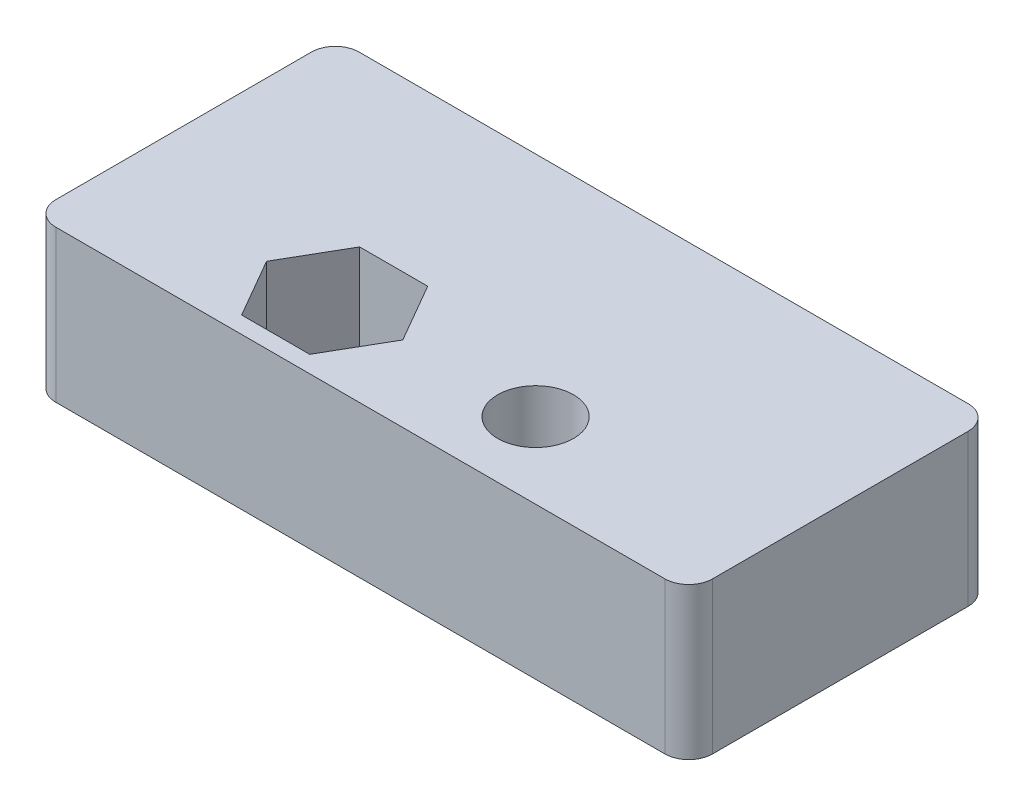
ISO-10303-21;
HEADER;
FILE_DESCRIPTION(('STEP AP214'),'2;1');
FILE_NAME('part.step','',(''),(''),'','','');
FILE_SCHEMA(('AUTOMOTIVE_DESIGN { 1 0 10303 214 1 1 1 1 }'));
ENDSEC;
DATA;
#1=APPLICATION_CONTEXT('core data for automotive mechanical design processes');
#2=APPLICATION_PROTOCOL_DEFINITION('international standard','automotive_design',2000,#1);
#3=PRODUCT_CONTEXT('',#1,'mechanical');
#4=PRODUCT('Part','Part','',(#3));
#5=PRODUCT_RELATED_PRODUCT_CATEGORY('part','',(#4));
#6=PRODUCT_DEFINITION_FORMATION('','',#4);
#7=PRODUCT_DEFINITION_CONTEXT('part definition',#1,'design');
#8=PRODUCT_DEFINITION('design','',#6,#7);
#9=PRODUCT_DEFINITION_SHAPE('','',#8);
#10=(LENGTH_UNIT() NAMED_UNIT(*) SI_UNIT(.MILLI.,.METRE.));
#11=(NAMED_UNIT(*) PLANE_ANGLE_UNIT() SI_UNIT($,.RADIAN.));
#12=(NAMED_UNIT(*) SI_UNIT($,.STERADIAN.) SOLID_ANGLE_UNIT());
#13=UNCERTAINTY_MEASURE_WITH_UNIT(LENGTH_MEASURE(1.E-05),#10,'distance_accuracy_value','');
#14=(GEOMETRIC_REPRESENTATION_CONTEXT(3) GLOBAL_UNCERTAINTY_ASSIGNED_CONTEXT((#13)) GLOBAL_UNIT_ASSIGNED_CONTEXT((#10,
#11,#12)) REPRESENTATION_CONTEXT('',''));
#15=CARTESIAN_POINT('',(0.,0.,0.));
#16=DIRECTION('',(0.,0.,1.));
#17=DIRECTION('',(1.,0.,0.));
#18=AXIS2_PLACEMENT_3D('',#15,#16,#17);
#19=CARTESIAN_POINT('',(0.,6.35,0.));
#20=DIRECTION('',(0.,-1.,0.));
#21=DIRECTION('',(0.,0.,-1.));
#22=AXIS2_PLACEMENT_3D('',#19,#20,#21);
#23=PLANE('',#22);
#24=CARTESIAN_POINT('',(17.9125,6.35,-3.175));
#25=DIRECTION('',(0.,1.,0.));
#26=DIRECTION('',(0.,0.,1.));
#27=AXIS2_PLACEMENT_3D('',#24,#25,#26);
#28=CIRCLE('',#27,1.5875);
#29=CARTESIAN_POINT('',(17.9125,6.35,-1.5875));
#30=VERTEX_POINT('',#29);
#31=EDGE_CURVE('E194',#30,#30,#28,.T.);
#32=ORIENTED_EDGE('',*,*,#31,.F.);
#33=EDGE_LOOP('',(#32));
#34=FACE_BOUND('',#33,.T.);
#35=DIRECTION('',(0.,0.,1.));
#36=VECTOR('',#35,1.);
#37=CARTESIAN_POINT('',(0.,6.35,0.));
#38=LINE('',#37,#36);
#39=CARTESIAN_POINT('',(0.,6.35,-11.7));
#40=VERTEX_POINT('',#39);
#41=CARTESIAN_POINT('',(0.,6.35,-1.));
#42=VERTEX_POINT('',#41);
#43=EDGE_CURVE('E200',#40,#42,#38,.T.);
#44=ORIENTED_EDGE('',*,*,#43,.T.);
#45=CARTESIAN_POINT('',(1.,6.35,-1.));
#46=DIRECTION('',(0.,-1.,0.));
#47=DIRECTION('',(0.,0.,-1.));
#48=AXIS2_PLACEMENT_3D('',#45,#46,#47);
#49=CIRCLE('',#48,1.);
#50=CARTESIAN_POINT('',(1.,6.35,0.));
#51=VERTEX_POINT('',#50);
#52=EDGE_CURVE('E243',#42,#51,#49,.F.);
#53=ORIENTED_EDGE('',*,*,#52,.T.);
#54=DIRECTION('',(1.,0.,0.));
#55=VECTOR('',#54,1.);
#56=CARTESIAN_POINT('',(0.,6.35,0.));
#57=LINE('',#56,#55);
#58=CARTESIAN_POINT('',(26.5,6.35,0.));
#59=VERTEX_POINT('',#58);
#60=EDGE_CURVE('E203',#51,#59,#57,.T.);
#61=ORIENTED_EDGE('',*,*,#60,.T.);
#62=CARTESIAN_POINT('',(26.5,6.35,-1.));
#63=DIRECTION('',(0.,-1.,0.));
#64=DIRECTION('',(0.,0.,-1.));
#65=AXIS2_PLACEMENT_3D('',#62,#63,#64);
#66=CIRCLE('',#65,1.);
#67=CARTESIAN_POINT('',(27.5,6.35,-1.));
#68=VERTEX_POINT('',#67);
#69=EDGE_CURVE('E238',#59,#68,#66,.F.);
#70=ORIENTED_EDGE('',*,*,#69,.T.);
#71=DIRECTION('',(0.,0.,-1.));
#72=VECTOR('',#71,1.);
#73=CARTESIAN_POINT('',(27.5,6.35,0.));
#74=LINE('',#73,#72);
#75=CARTESIAN_POINT('',(27.5,6.35,-11.7));
#76=VERTEX_POINT('',#75);
#77=EDGE_CURVE('E207',#68,#76,#74,.T.);
#78=ORIENTED_EDGE('',*,*,#77,.T.);
#79=CARTESIAN_POINT('',(26.5,6.35,-11.7));
#80=DIRECTION('',(0.,-1.,0.));
#81=DIRECTION('',(0.,0.,-1.));
#82=AXIS2_PLACEMENT_3D('',#79,#80,#81);
#83=CIRCLE('',#82,1.);
#84=CARTESIAN_POINT('',(26.5,6.35,-12.7));
#85=VERTEX_POINT('',#84);
#86=EDGE_CURVE('E57',#76,#85,#83,.F.);
#87=ORIENTED_EDGE('',*,*,#86,.T.);
#88=DIRECTION('',(-1.,0.,0.));
#89=VECTOR('',#88,1.);
#90=CARTESIAN_POINT('',(0.,6.35,-12.7));
#91=LINE('',#90,#89);
#92=CARTESIAN_POINT('',(1.,6.35,-12.7));
#93=VERTEX_POINT('',#92);
#94=EDGE_CURVE('E209',#85,#93,#91,.T.);
#95=ORIENTED_EDGE('',*,*,#94,.T.);
#96=CARTESIAN_POINT('',(1.,6.35,-11.7));
#97=DIRECTION('',(0.,-1.,0.));
#98=DIRECTION('',(0.,0.,-1.));
#99=AXIS2_PLACEMENT_3D('',#96,#97,#98);
#100=CIRCLE('',#99,1.);
#101=EDGE_CURVE('E241',#93,#40,#100,.F.);
#102=ORIENTED_EDGE('',*,*,#101,.T.);
#103=EDGE_LOOP('',(#44,#53,#61,#70,#78,#87,#95,#102));
#104=FACE_BOUND('',#103,.T.);
#105=DIRECTION('',(0.5,0.,-0.866025403784439));
#106=VECTOR('',#105,1.);
#107=CARTESIAN_POINT('',(10.9261417674388,6.35,-0.704849999999999));
#108=LINE('',#107,#106);
#109=CARTESIAN_POINT('',(10.9261417674388,6.35,-0.704849999999999));
#110=VERTEX_POINT('',#109);
#111=CARTESIAN_POINT('',(12.3522835348775,6.35,-3.175));
#112=VERTEX_POINT('',#111);
#113=EDGE_CURVE('E138',#110,#112,#108,.T.);
#114=ORIENTED_EDGE('',*,*,#113,.F.);
#115=DIRECTION('',(1.,0.,0.));
#116=VECTOR('',#115,1.);
#117=CARTESIAN_POINT('',(8.07385823256124,6.35,-0.70485));
#118=LINE('',#117,#116);
#119=CARTESIAN_POINT('',(8.07385823256124,6.35,-0.70485));
#120=VERTEX_POINT('',#119);
#121=EDGE_CURVE('E170',#120,#110,#118,.T.);
#122=ORIENTED_EDGE('',*,*,#121,.F.);
#123=DIRECTION('',(0.5,0.,0.866025403784439));
#124=VECTOR('',#123,1.);
#125=CARTESIAN_POINT('',(6.64771646512249,6.35,-3.175));
#126=LINE('',#125,#124);
#127=CARTESIAN_POINT('',(6.64771646512249,6.35,-3.175));
#128=VERTEX_POINT('',#127);
#129=EDGE_CURVE('E167',#128,#120,#126,.T.);
#130=ORIENTED_EDGE('',*,*,#129,.F.);
#131=DIRECTION('',(-0.5,0.,0.866025403784439));
#132=VECTOR('',#131,1.);
#133=CARTESIAN_POINT('',(8.07385823256125,6.35,-5.64515));
#134=LINE('',#133,#132);
#135=CARTESIAN_POINT('',(8.07385823256125,6.35,-5.64515));
#136=VERTEX_POINT('',#135);
#137=EDGE_CURVE('E163',#136,#128,#134,.T.);
#138=ORIENTED_EDGE('',*,*,#137,.F.);
#139=DIRECTION('',(-1.,0.,0.));
#140=VECTOR('',#139,1.);
#141=CARTESIAN_POINT('',(10.9261417674388,6.35,-5.64515));
#142=LINE('',#141,#140);
#143=CARTESIAN_POINT('',(10.9261417674388,6.35,-5.64515));
#144=VERTEX_POINT('',#143);
#145=EDGE_CURVE('E161',#144,#136,#142,.T.);
#146=ORIENTED_EDGE('',*,*,#145,.F.);
#147=DIRECTION('',(-0.5,0.,-0.866025403784439));
#148=VECTOR('',#147,1.);
#149=CARTESIAN_POINT('',(12.3522835348775,6.35,-3.175));
#150=LINE('',#149,#148);
#151=EDGE_CURVE('E148',#112,#144,#150,.T.);
#152=ORIENTED_EDGE('',*,*,#151,.F.);
#153=EDGE_LOOP('',(#114,#122,#130,#138,#146,#152));
#154=FACE_BOUND('',#153,.T.);
#155=ADVANCED_FACE('F35',(#34,#104,#154),#23,.F.);
#156=CARTESIAN_POINT('',(0.,0.,0.));
#157=DIRECTION('',(0.,-1.,0.));
#158=DIRECTION('',(0.,0.,-1.));
#159=AXIS2_PLACEMENT_3D('',#156,#157,#158);
#160=PLANE('',#159);
#161=DIRECTION('',(1.,0.,0.));
#162=VECTOR('',#161,1.);
#163=CARTESIAN_POINT('',(0.,0.,0.));
#164=LINE('',#163,#162);
#165=CARTESIAN_POINT('',(1.,0.,0.));
#166=VERTEX_POINT('',#165);
#167=CARTESIAN_POINT('',(26.5,0.,0.));
#168=VERTEX_POINT('',#167);
#169=EDGE_CURVE('E214',#166,#168,#164,.T.);
#170=ORIENTED_EDGE('',*,*,#169,.F.);
#171=CARTESIAN_POINT('',(1.,0.,-1.));
#172=DIRECTION('',(0.,-1.,0.));
#173=DIRECTION('',(0.,0.,-1.));
#174=AXIS2_PLACEMENT_3D('',#171,#172,#173);
#175=CIRCLE('',#174,1.);
#176=CARTESIAN_POINT('',(0.,0.,-1.));
#177=VERTEX_POINT('',#176);
#178=EDGE_CURVE('E231',#166,#177,#175,.T.);
#179=ORIENTED_EDGE('',*,*,#178,.T.);
#180=DIRECTION('',(0.,0.,1.));
#181=VECTOR('',#180,1.);
#182=CARTESIAN_POINT('',(0.,0.,0.));
#183=LINE('',#182,#181);
#184=CARTESIAN_POINT('',(0.,0.,-11.7));
#185=VERTEX_POINT('',#184);
#186=EDGE_CURVE('E197',#185,#177,#183,.T.);
#187=ORIENTED_EDGE('',*,*,#186,.F.);
#188=CARTESIAN_POINT('',(1.,0.,-11.7));
#189=DIRECTION('',(0.,-1.,0.));
#190=DIRECTION('',(0.,0.,-1.));
#191=AXIS2_PLACEMENT_3D('',#188,#189,#190);
#192=CIRCLE('',#191,1.);
#193=CARTESIAN_POINT('',(1.,0.,-12.7));
#194=VERTEX_POINT('',#193);
#195=EDGE_CURVE('E229',#185,#194,#192,.T.);
#196=ORIENTED_EDGE('',*,*,#195,.T.);
#197=DIRECTION('',(-1.,0.,0.));
#198=VECTOR('',#197,1.);
#199=CARTESIAN_POINT('',(0.,0.,-12.7));
#200=LINE('',#199,#198);
#201=CARTESIAN_POINT('',(26.5,0.,-12.7));
#202=VERTEX_POINT('',#201);
#203=EDGE_CURVE('E204',#202,#194,#200,.T.);
#204=ORIENTED_EDGE('',*,*,#203,.F.);
#205=CARTESIAN_POINT('',(26.5,0.,-11.7));
#206=DIRECTION('',(0.,-1.,0.));
#207=DIRECTION('',(0.,0.,-1.));
#208=AXIS2_PLACEMENT_3D('',#205,#206,#207);
#209=CIRCLE('',#208,1.);
#210=CARTESIAN_POINT('',(27.5,0.,-11.7));
#211=VERTEX_POINT('',#210);
#212=EDGE_CURVE('E227',#202,#211,#209,.T.);
#213=ORIENTED_EDGE('',*,*,#212,.T.);
#214=DIRECTION('',(0.,0.,-1.));
#215=VECTOR('',#214,1.);
#216=CARTESIAN_POINT('',(27.5,0.,0.));
#217=LINE('',#216,#215);
#218=CARTESIAN_POINT('',(27.5,0.,-1.));
#219=VERTEX_POINT('',#218);
#220=EDGE_CURVE('E217',#219,#211,#217,.T.);
#221=ORIENTED_EDGE('',*,*,#220,.F.);
#222=CARTESIAN_POINT('',(26.5,0.,-1.));
#223=DIRECTION('',(0.,-1.,0.));
#224=DIRECTION('',(0.,0.,-1.));
#225=AXIS2_PLACEMENT_3D('',#222,#223,#224);
#226=CIRCLE('',#225,1.);
#227=EDGE_CURVE('E225',#219,#168,#226,.T.);
#228=ORIENTED_EDGE('',*,*,#227,.T.);
#229=EDGE_LOOP('',(#170,#179,#187,#196,#204,#213,#221,#228));
#230=FACE_BOUND('',#229,.T.);
#231=CARTESIAN_POINT('',(17.9125,0.,-3.175));
#232=DIRECTION('',(0.,1.,0.));
#233=DIRECTION('',(0.,0.,1.));
#234=AXIS2_PLACEMENT_3D('',#231,#232,#233);
#235=CIRCLE('',#234,1.5875);
#236=CARTESIAN_POINT('',(17.9125,0.,-1.5875));
#237=VERTEX_POINT('',#236);
#238=EDGE_CURVE('E156',#237,#237,#235,.T.);
#239=ORIENTED_EDGE('',*,*,#238,.T.);
#240=EDGE_LOOP('',(#239));
#241=FACE_BOUND('',#240,.T.);
#242=DIRECTION('',(1.,0.,0.));
#243=VECTOR('',#242,1.);
#244=CARTESIAN_POINT('',(8.07385823256124,0.,-0.70485));
#245=LINE('',#244,#243);
#246=CARTESIAN_POINT('',(8.07385823256124,0.,-0.70485));
#247=VERTEX_POINT('',#246);
#248=CARTESIAN_POINT('',(10.9261417674388,0.,-0.704849999999999));
#249=VERTEX_POINT('',#248);
#250=EDGE_CURVE('E149',#247,#249,#245,.T.);
#251=ORIENTED_EDGE('',*,*,#250,.T.);
#252=DIRECTION('',(0.5,0.,-0.866025403784439));
#253=VECTOR('',#252,1.);
#254=CARTESIAN_POINT('',(10.9261417674388,0.,-0.704849999999999));
#255=LINE('',#254,#253);
#256=CARTESIAN_POINT('',(12.3522835348775,0.,-3.175));
#257=VERTEX_POINT('',#256);
#258=EDGE_CURVE('E172',#249,#257,#255,.T.);
#259=ORIENTED_EDGE('',*,*,#258,.T.);
#260=DIRECTION('',(-0.5,0.,-0.866025403784439));
#261=VECTOR('',#260,1.);
#262=CARTESIAN_POINT('',(12.3522835348775,0.,-3.175));
#263=LINE('',#262,#261);
#264=CARTESIAN_POINT('',(10.9261417674388,0.,-5.64515));
#265=VERTEX_POINT('',#264);
#266=EDGE_CURVE('E155',#257,#265,#263,.T.);
#267=ORIENTED_EDGE('',*,*,#266,.T.);
#268=DIRECTION('',(-1.,0.,0.));
#269=VECTOR('',#268,1.);
#270=CARTESIAN_POINT('',(10.9261417674388,0.,-5.64515));
#271=LINE('',#270,#269);
#272=CARTESIAN_POINT('',(8.07385823256125,0.,-5.64515));
#273=VERTEX_POINT('',#272);
#274=EDGE_CURVE('E175',#265,#273,#271,.T.);
#275=ORIENTED_EDGE('',*,*,#274,.T.);
#276=DIRECTION('',(-0.5,0.,0.866025403784439));
#277=VECTOR('',#276,1.);
#278=CARTESIAN_POINT('',(8.07385823256125,0.,-5.64515));
#279=LINE('',#278,#277);
#280=CARTESIAN_POINT('',(6.64771646512249,0.,-3.175));
#281=VERTEX_POINT('',#280);
#282=EDGE_CURVE('E178',#273,#281,#279,.T.);
#283=ORIENTED_EDGE('',*,*,#282,.T.);
#284=DIRECTION('',(0.5,0.,0.866025403784439));
#285=VECTOR('',#284,1.);
#286=CARTESIAN_POINT('',(6.64771646512249,0.,-3.175));
#287=LINE('',#286,#285);
#288=EDGE_CURVE('E181',#281,#247,#287,.T.);
#289=ORIENTED_EDGE('',*,*,#288,.T.);
#290=EDGE_LOOP('',(#251,#259,#267,#275,#283,#289));
#291=FACE_BOUND('',#290,.T.);
#292=ADVANCED_FACE('F259',(#230,#241,#291),#160,.T.);
#293=CARTESIAN_POINT('',(0.,6.35,0.));
#294=DIRECTION('',(1.,0.,0.));
#295=DIRECTION('',(0.,0.,-1.));
#296=AXIS2_PLACEMENT_3D('',#293,#294,#295);
#297=PLANE('',#296);
#298=ORIENTED_EDGE('',*,*,#186,.T.);
#299=DIRECTION('',(0.,-1.,0.));
#300=VECTOR('',#299,1.);
#301=CARTESIAN_POINT('',(0.,6.35,-1.));
#302=LINE('',#301,#300);
#303=EDGE_CURVE('E236',#177,#42,#302,.F.);
#304=ORIENTED_EDGE('',*,*,#303,.T.);
#305=ORIENTED_EDGE('',*,*,#43,.F.);
#306=DIRECTION('',(0.,-1.,0.));
#307=VECTOR('',#306,1.);
#308=CARTESIAN_POINT('',(0.,6.35,-11.7));
#309=LINE('',#308,#307);
#310=EDGE_CURVE('E233',#40,#185,#309,.T.);
#311=ORIENTED_EDGE('',*,*,#310,.T.);
#312=EDGE_LOOP('',(#298,#304,#305,#311));
#313=FACE_BOUND('',#312,.T.);
#314=ADVANCED_FACE('F273',(#313),#297,.F.);
#315=CARTESIAN_POINT('',(0.,6.35,0.));
#316=DIRECTION('',(0.,0.,-1.));
#317=DIRECTION('',(-1.,0.,0.));
#318=AXIS2_PLACEMENT_3D('',#315,#316,#317);
#319=PLANE('',#318);
#320=ORIENTED_EDGE('',*,*,#60,.F.);
#321=DIRECTION('',(0.,-1.,0.));
#322=VECTOR('',#321,1.);
#323=CARTESIAN_POINT('',(1.,6.35,0.));
#324=LINE('',#323,#322);
#325=EDGE_CURVE('E222',#51,#166,#324,.T.);
#326=ORIENTED_EDGE('',*,*,#325,.T.);
#327=ORIENTED_EDGE('',*,*,#169,.T.);
#328=DIRECTION('',(0.,-1.,0.));
#329=VECTOR('',#328,1.);
#330=CARTESIAN_POINT('',(26.5,6.35,0.));
#331=LINE('',#330,#329);
#332=EDGE_CURVE('E211',#168,#59,#331,.F.);
#333=ORIENTED_EDGE('',*,*,#332,.T.);
#334=EDGE_LOOP('',(#320,#326,#327,#333));
#335=FACE_BOUND('',#334,.T.);
#336=ADVANCED_FACE('F281',(#335),#319,.F.);
#337=CARTESIAN_POINT('',(27.5,6.35,0.));
#338=DIRECTION('',(-1.,0.,0.));
#339=DIRECTION('',(0.,0.,1.));
#340=AXIS2_PLACEMENT_3D('',#337,#338,#339);
#341=PLANE('',#340);
#342=ORIENTED_EDGE('',*,*,#220,.T.);
#343=DIRECTION('',(0.,-1.,0.));
#344=VECTOR('',#343,1.);
#345=CARTESIAN_POINT('',(27.5,6.35,-11.7));
#346=LINE('',#345,#344);
#347=EDGE_CURVE('E11',#211,#76,#346,.F.);
#348=ORIENTED_EDGE('',*,*,#347,.T.);
#349=ORIENTED_EDGE('',*,*,#77,.F.);
#350=DIRECTION('',(0.,-1.,0.));
#351=VECTOR('',#350,1.);
#352=CARTESIAN_POINT('',(27.5,6.35,-1.));
#353=LINE('',#352,#351);
#354=EDGE_CURVE('E43',#68,#219,#353,.T.);
#355=ORIENTED_EDGE('',*,*,#354,.T.);
#356=EDGE_LOOP('',(#342,#348,#349,#355));
#357=FACE_BOUND('',#356,.T.);
#358=ADVANCED_FACE('F253',(#357),#341,.F.);
#359=CARTESIAN_POINT('',(0.,6.35,-12.7));
#360=DIRECTION('',(0.,0.,1.));
#361=DIRECTION('',(1.,0.,0.));
#362=AXIS2_PLACEMENT_3D('',#359,#360,#361);
#363=PLANE('',#362);
#364=ORIENTED_EDGE('',*,*,#203,.T.);
#365=DIRECTION('',(0.,-1.,0.));
#366=VECTOR('',#365,1.);
#367=CARTESIAN_POINT('',(1.,6.35,-12.7));
#368=LINE('',#367,#366);
#369=EDGE_CURVE('E50',#194,#93,#368,.F.);
#370=ORIENTED_EDGE('',*,*,#369,.T.);
#371=ORIENTED_EDGE('',*,*,#94,.F.);
#372=DIRECTION('',(0.,-1.,0.));
#373=VECTOR('',#372,1.);
#374=CARTESIAN_POINT('',(26.5,6.35,-12.7));
#375=LINE('',#374,#373);
#376=EDGE_CURVE('E245',#85,#202,#375,.T.);
#377=ORIENTED_EDGE('',*,*,#376,.T.);
#378=EDGE_LOOP('',(#364,#370,#371,#377));
#379=FACE_BOUND('',#378,.T.);
#380=ADVANCED_FACE('F265',(#379),#363,.F.);
#381=CARTESIAN_POINT('',(17.9125,6.35,-3.175));
#382=DIRECTION('',(0.,-1.,0.));
#383=DIRECTION('',(0.,0.,-1.));
#384=AXIS2_PLACEMENT_3D('',#381,#382,#383);
#385=CYLINDRICAL_SURFACE('',#384,1.5875);
#386=ORIENTED_EDGE('',*,*,#31,.T.);
#387=EDGE_LOOP('',(#386));
#388=FACE_BOUND('',#387,.T.);
#389=ORIENTED_EDGE('',*,*,#238,.F.);
#390=EDGE_LOOP('',(#389));
#391=FACE_BOUND('',#390,.T.);
#392=ADVANCED_FACE('F296',(#388,#391),#385,.F.);
#393=CARTESIAN_POINT('',(10.9261417674388,6.35,-0.704849999999999));
#394=DIRECTION('',(-0.866025403784438,0.,-0.5));
#395=DIRECTION('',(-0.5,0.,0.866025403784439));
#396=AXIS2_PLACEMENT_3D('',#393,#394,#395);
#397=PLANE('',#396);
#398=ORIENTED_EDGE('',*,*,#258,.F.);
#399=DIRECTION('',(0.,-1.,0.));
#400=VECTOR('',#399,1.);
#401=CARTESIAN_POINT('',(10.9261417674388,6.35,-0.704849999999999));
#402=LINE('',#401,#400);
#403=EDGE_CURVE('E144',#110,#249,#402,.T.);
#404=ORIENTED_EDGE('',*,*,#403,.F.);
#405=ORIENTED_EDGE('',*,*,#113,.T.);
#406=DIRECTION('',(0.,-1.,0.));
#407=VECTOR('',#406,1.);
#408=CARTESIAN_POINT('',(12.3522835348775,6.35,-3.175));
#409=LINE('',#408,#407);
#410=EDGE_CURVE('E141',#112,#257,#409,.T.);
#411=ORIENTED_EDGE('',*,*,#410,.T.);
#412=EDGE_LOOP('',(#398,#404,#405,#411));
#413=FACE_BOUND('',#412,.T.);
#414=ADVANCED_FACE('F140',(#413),#397,.T.);
#415=CARTESIAN_POINT('',(12.3522835348775,6.35,-3.175));
#416=DIRECTION('',(-0.866025403784439,0.,0.5));
#417=DIRECTION('',(0.5,0.,0.866025403784439));
#418=AXIS2_PLACEMENT_3D('',#415,#416,#417);
#419=PLANE('',#418);
#420=ORIENTED_EDGE('',*,*,#266,.F.);
#421=ORIENTED_EDGE('',*,*,#410,.F.);
#422=ORIENTED_EDGE('',*,*,#151,.T.);
#423=DIRECTION('',(0.,-1.,0.));
#424=VECTOR('',#423,1.);
#425=CARTESIAN_POINT('',(10.9261417674388,6.35,-5.64515));
#426=LINE('',#425,#424);
#427=EDGE_CURVE('E157',#144,#265,#426,.T.);
#428=ORIENTED_EDGE('',*,*,#427,.T.);
#429=EDGE_LOOP('',(#420,#421,#422,#428));
#430=FACE_BOUND('',#429,.T.);
#431=ADVANCED_FACE('F152',(#430),#419,.T.);
#432=CARTESIAN_POINT('',(10.9261417674388,6.35,-5.64515));
#433=DIRECTION('',(0.,0.,1.));
#434=DIRECTION('',(1.,0.,0.));
#435=AXIS2_PLACEMENT_3D('',#432,#433,#434);
#436=PLANE('',#435);
#437=ORIENTED_EDGE('',*,*,#274,.F.);
#438=ORIENTED_EDGE('',*,*,#427,.F.);
#439=ORIENTED_EDGE('',*,*,#145,.T.);
#440=DIRECTION('',(0.,-1.,0.));
#441=VECTOR('',#440,1.);
#442=CARTESIAN_POINT('',(8.07385823256125,6.35,-5.64515));
#443=LINE('',#442,#441);
#444=EDGE_CURVE('E191',#136,#273,#443,.T.);
#445=ORIENTED_EDGE('',*,*,#444,.T.);
#446=EDGE_LOOP('',(#437,#438,#439,#445));
#447=FACE_BOUND('',#446,.T.);
#448=ADVANCED_FACE('F358',(#447),#436,.T.);
#449=CARTESIAN_POINT('',(8.07385823256125,6.35,-5.64515));
#450=DIRECTION('',(0.866025403784439,0.,0.5));
#451=DIRECTION('',(0.5,0.,-0.866025403784439));
#452=AXIS2_PLACEMENT_3D('',#449,#450,#451);
#453=PLANE('',#452);
#454=ORIENTED_EDGE('',*,*,#282,.F.);
#455=ORIENTED_EDGE('',*,*,#444,.F.);
#456=ORIENTED_EDGE('',*,*,#137,.T.);
#457=DIRECTION('',(0.,-1.,0.));
#458=VECTOR('',#457,1.);
#459=CARTESIAN_POINT('',(6.64771646512249,6.35,-3.175));
#460=LINE('',#459,#458);
#461=EDGE_CURVE('E189',#128,#281,#460,.T.);
#462=ORIENTED_EDGE('',*,*,#461,.T.);
#463=EDGE_LOOP('',(#454,#455,#456,#462));
#464=FACE_BOUND('',#463,.T.);
#465=ADVANCED_FACE('F349',(#464),#453,.T.);
#466=CARTESIAN_POINT('',(6.64771646512249,6.35,-3.175));
#467=DIRECTION('',(0.866025403784439,0.,-0.5));
#468=DIRECTION('',(-0.5,0.,-0.866025403784439));
#469=AXIS2_PLACEMENT_3D('',#466,#467,#468);
#470=PLANE('',#469);
#471=ORIENTED_EDGE('',*,*,#288,.F.);
#472=ORIENTED_EDGE('',*,*,#461,.F.);
#473=ORIENTED_EDGE('',*,*,#129,.T.);
#474=DIRECTION('',(0.,-1.,0.));
#475=VECTOR('',#474,1.);
#476=CARTESIAN_POINT('',(8.07385823256124,6.35,-0.70485));
#477=LINE('',#476,#475);
#478=EDGE_CURVE('E187',#120,#247,#477,.T.);
#479=ORIENTED_EDGE('',*,*,#478,.T.);
#480=EDGE_LOOP('',(#471,#472,#473,#479));
#481=FACE_BOUND('',#480,.T.);
#482=ADVANCED_FACE('F340',(#481),#470,.T.);
#483=CARTESIAN_POINT('',(8.07385823256124,6.35,-0.70485));
#484=DIRECTION('',(0.,0.,-1.));
#485=DIRECTION('',(-1.,0.,0.));
#486=AXIS2_PLACEMENT_3D('',#483,#484,#485);
#487=PLANE('',#486);
#488=ORIENTED_EDGE('',*,*,#250,.F.);
#489=ORIENTED_EDGE('',*,*,#478,.F.);
#490=ORIENTED_EDGE('',*,*,#121,.T.);
#491=ORIENTED_EDGE('',*,*,#403,.T.);
#492=EDGE_LOOP('',(#488,#489,#490,#491));
#493=FACE_BOUND('',#492,.T.);
#494=ADVANCED_FACE('F309',(#493),#487,.T.);
#495=CARTESIAN_POINT('',(1.,6.35,-1.));
#496=DIRECTION('',(0.,-1.,0.));
#497=DIRECTION('',(0.,0.,-1.));
#498=AXIS2_PLACEMENT_3D('',#495,#496,#497);
#499=CYLINDRICAL_SURFACE('',#498,1.);
#500=ORIENTED_EDGE('',*,*,#52,.F.);
#501=ORIENTED_EDGE('',*,*,#303,.F.);
#502=ORIENTED_EDGE('',*,*,#178,.F.);
#503=ORIENTED_EDGE('',*,*,#325,.F.);
#504=EDGE_LOOP('',(#500,#501,#502,#503));
#505=FACE_BOUND('',#504,.T.);
#506=ADVANCED_FACE('F278',(#505),#499,.T.);
#507=CARTESIAN_POINT('',(1.,6.35,-11.7));
#508=DIRECTION('',(0.,-1.,0.));
#509=DIRECTION('',(0.,0.,-1.));
#510=AXIS2_PLACEMENT_3D('',#507,#508,#509);
#511=CYLINDRICAL_SURFACE('',#510,1.);
#512=ORIENTED_EDGE('',*,*,#101,.F.);
#513=ORIENTED_EDGE('',*,*,#369,.F.);
#514=ORIENTED_EDGE('',*,*,#195,.F.);
#515=ORIENTED_EDGE('',*,*,#310,.F.);
#516=EDGE_LOOP('',(#512,#513,#514,#515));
#517=FACE_BOUND('',#516,.T.);
#518=ADVANCED_FACE('F270',(#517),#511,.T.);
#519=CARTESIAN_POINT('',(26.5,6.35,-11.7));
#520=DIRECTION('',(0.,-1.,0.));
#521=DIRECTION('',(0.,0.,-1.));
#522=AXIS2_PLACEMENT_3D('',#519,#520,#521);
#523=CYLINDRICAL_SURFACE('',#522,1.);
#524=ORIENTED_EDGE('',*,*,#86,.F.);
#525=ORIENTED_EDGE('',*,*,#347,.F.);
#526=ORIENTED_EDGE('',*,*,#212,.F.);
#527=ORIENTED_EDGE('',*,*,#376,.F.);
#528=EDGE_LOOP('',(#524,#525,#526,#527));
#529=FACE_BOUND('',#528,.T.);
#530=ADVANCED_FACE('F264',(#529),#523,.T.);
#531=CARTESIAN_POINT('',(26.5,6.35,-1.));
#532=DIRECTION('',(0.,-1.,0.));
#533=DIRECTION('',(0.,0.,-1.));
#534=AXIS2_PLACEMENT_3D('',#531,#532,#533);
#535=CYLINDRICAL_SURFACE('',#534,1.);
#536=ORIENTED_EDGE('',*,*,#69,.F.);
#537=ORIENTED_EDGE('',*,*,#332,.F.);
#538=ORIENTED_EDGE('',*,*,#227,.F.);
#539=ORIENTED_EDGE('',*,*,#354,.F.);
#540=EDGE_LOOP('',(#536,#537,#538,#539));
#541=FACE_BOUND('',#540,.T.);
#542=ADVANCED_FACE('F37',(#541),#535,.T.);
#543=CLOSED_SHELL('',(#155,#292,#314,#336,#358,#380,#392,#414,#431,#448,#465,#482,#494,#506,
#518,#530,#542));
#544=MANIFOLD_SOLID_BREP('B2',#543);
#545=ADVANCED_BREP_SHAPE_REPRESENTATION('',(#18,#544),#14);
#546=SHAPE_DEFINITION_REPRESENTATION(#9,#545);
ENDSEC;
END-ISO-10303-21;
